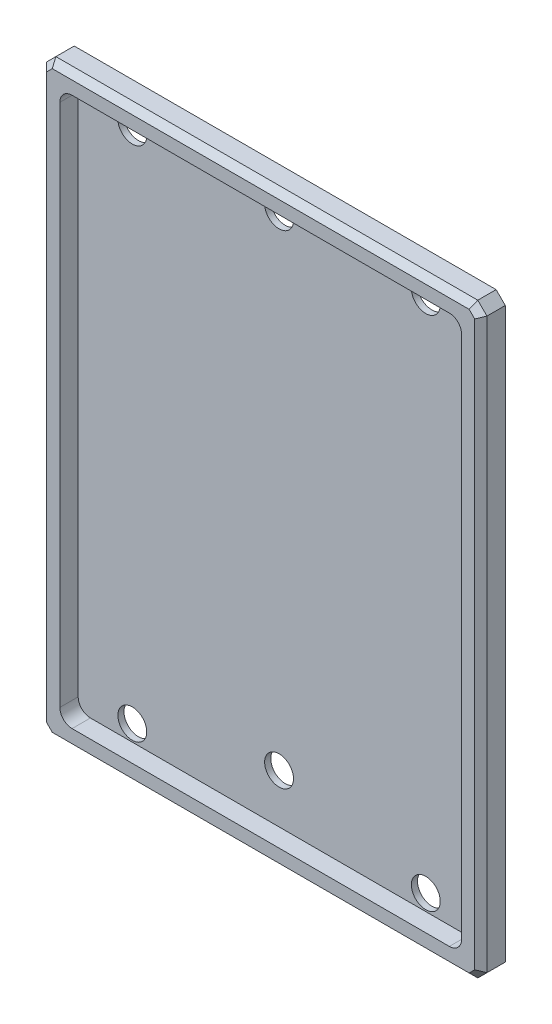
ISO-10303-21;
HEADER;
FILE_DESCRIPTION(('STEP AP214'),'2;1');
FILE_NAME('part.step','',(''),(''),'','','');
FILE_SCHEMA(('AUTOMOTIVE_DESIGN { 1 0 10303 214 1 1 1 1 }'));
ENDSEC;
DATA;
#1=APPLICATION_CONTEXT('core data for automotive mechanical design processes');
#2=APPLICATION_PROTOCOL_DEFINITION('international standard','automotive_design',2000,#1);
#3=PRODUCT_CONTEXT('',#1,'mechanical');
#4=PRODUCT('Part','Part','',(#3));
#5=PRODUCT_RELATED_PRODUCT_CATEGORY('part','',(#4));
#6=PRODUCT_DEFINITION_FORMATION('','',#4);
#7=PRODUCT_DEFINITION_CONTEXT('part definition',#1,'design');
#8=PRODUCT_DEFINITION('design','',#6,#7);
#9=PRODUCT_DEFINITION_SHAPE('','',#8);
#10=(LENGTH_UNIT() NAMED_UNIT(*) SI_UNIT(.MILLI.,.METRE.));
#11=(NAMED_UNIT(*) PLANE_ANGLE_UNIT() SI_UNIT($,.RADIAN.));
#12=(NAMED_UNIT(*) SI_UNIT($,.STERADIAN.) SOLID_ANGLE_UNIT());
#13=UNCERTAINTY_MEASURE_WITH_UNIT(LENGTH_MEASURE(1.E-05),#10,'distance_accuracy_value','');
#14=(GEOMETRIC_REPRESENTATION_CONTEXT(3) GLOBAL_UNCERTAINTY_ASSIGNED_CONTEXT((#13)) GLOBAL_UNIT_ASSIGNED_CONTEXT((#10,
#11,#12)) REPRESENTATION_CONTEXT('',''));
#15=CARTESIAN_POINT('',(0.,0.,0.));
#16=DIRECTION('',(0.,0.,1.));
#17=DIRECTION('',(1.,0.,0.));
#18=AXIS2_PLACEMENT_3D('',#15,#16,#17);
#19=CARTESIAN_POINT('',(-114.3,-152.4,12.7));
#20=DIRECTION('',(1.,0.,0.));
#21=DIRECTION('',(0.,0.,-1.));
#22=AXIS2_PLACEMENT_3D('',#19,#20,#21);
#23=PLANE('',#22);
#24=DIRECTION('',(0.,0.,1.));
#25=VECTOR('',#24,1.);
#26=CARTESIAN_POINT('',(-114.3,-147.6375,12.7));
#27=LINE('',#26,#25);
#28=CARTESIAN_POINT('',(-114.3,-147.6375,0.));
#29=VERTEX_POINT('',#28);
#30=CARTESIAN_POINT('',(-114.3,-147.6375,9.52499999999996));
#31=VERTEX_POINT('',#30);
#32=EDGE_CURVE('E341',#29,#31,#27,.T.);
#33=ORIENTED_EDGE('',*,*,#32,.T.);
#34=DIRECTION('',(0.,1.,0.));
#35=VECTOR('',#34,1.);
#36=CARTESIAN_POINT('',(-114.3,147.6375,9.52499999999996));
#37=LINE('',#36,#35);
#38=CARTESIAN_POINT('',(-114.3,147.6375,9.52499999999996));
#39=VERTEX_POINT('',#38);
#40=EDGE_CURVE('E11',#31,#39,#37,.T.);
#41=ORIENTED_EDGE('',*,*,#40,.T.);
#42=DIRECTION('',(0.,0.,-1.));
#43=VECTOR('',#42,1.);
#44=CARTESIAN_POINT('',(-114.3,147.6375,12.7));
#45=LINE('',#44,#43);
#46=CARTESIAN_POINT('',(-114.3,147.6375,0.));
#47=VERTEX_POINT('',#46);
#48=EDGE_CURVE('E339',#39,#47,#45,.T.);
#49=ORIENTED_EDGE('',*,*,#48,.T.);
#50=DIRECTION('',(0.,-1.,0.));
#51=VECTOR('',#50,1.);
#52=CARTESIAN_POINT('',(-114.3,-152.4,0.));
#53=LINE('',#52,#51);
#54=EDGE_CURVE('E301',#47,#29,#53,.T.);
#55=ORIENTED_EDGE('',*,*,#54,.T.);
#56=EDGE_LOOP('',(#33,#41,#49,#55));
#57=FACE_BOUND('',#56,.T.);
#58=ADVANCED_FACE('F41',(#57),#23,.F.);
#59=CARTESIAN_POINT('',(114.3,-152.4,12.7));
#60=DIRECTION('',(0.,1.,0.));
#61=DIRECTION('',(0.,0.,1.));
#62=AXIS2_PLACEMENT_3D('',#59,#60,#61);
#63=PLANE('',#62);
#64=DIRECTION('',(0.,0.,1.));
#65=VECTOR('',#64,1.);
#66=CARTESIAN_POINT('',(109.5375,-152.4,12.7));
#67=LINE('',#66,#65);
#68=CARTESIAN_POINT('',(109.5375,-152.4,0.));
#69=VERTEX_POINT('',#68);
#70=CARTESIAN_POINT('',(109.5375,-152.4,9.52499999999996));
#71=VERTEX_POINT('',#70);
#72=EDGE_CURVE('E327',#69,#71,#67,.T.);
#73=ORIENTED_EDGE('',*,*,#72,.T.);
#74=DIRECTION('',(-1.,0.,0.));
#75=VECTOR('',#74,1.);
#76=CARTESIAN_POINT('',(-109.5375,-152.4,9.52499999999996));
#77=LINE('',#76,#75);
#78=CARTESIAN_POINT('',(-109.5375,-152.4,9.52499999999996));
#79=VERTEX_POINT('',#78);
#80=EDGE_CURVE('E66',#71,#79,#77,.T.);
#81=ORIENTED_EDGE('',*,*,#80,.T.);
#82=DIRECTION('',(0.,0.,-1.));
#83=VECTOR('',#82,1.);
#84=CARTESIAN_POINT('',(-109.5375,-152.4,12.7));
#85=LINE('',#84,#83);
#86=CARTESIAN_POINT('',(-109.5375,-152.4,0.));
#87=VERTEX_POINT('',#86);
#88=EDGE_CURVE('E329',#79,#87,#85,.T.);
#89=ORIENTED_EDGE('',*,*,#88,.T.);
#90=DIRECTION('',(1.,0.,0.));
#91=VECTOR('',#90,1.);
#92=CARTESIAN_POINT('',(114.3,-152.4,0.));
#93=LINE('',#92,#91);
#94=EDGE_CURVE('E318',#87,#69,#93,.T.);
#95=ORIENTED_EDGE('',*,*,#94,.T.);
#96=EDGE_LOOP('',(#73,#81,#89,#95));
#97=FACE_BOUND('',#96,.T.);
#98=ADVANCED_FACE('F418',(#97),#63,.F.);
#99=CARTESIAN_POINT('',(114.3,-152.4,12.7));
#100=DIRECTION('',(-1.,0.,0.));
#101=DIRECTION('',(0.,0.,1.));
#102=AXIS2_PLACEMENT_3D('',#99,#100,#101);
#103=PLANE('',#102);
#104=DIRECTION('',(0.,0.,1.));
#105=VECTOR('',#104,1.);
#106=CARTESIAN_POINT('',(114.3,147.6375,12.7));
#107=LINE('',#106,#105);
#108=CARTESIAN_POINT('',(114.3,147.6375,0.));
#109=VERTEX_POINT('',#108);
#110=CARTESIAN_POINT('',(114.3,147.6375,9.52499999999996));
#111=VERTEX_POINT('',#110);
#112=EDGE_CURVE('E343',#109,#111,#107,.T.);
#113=ORIENTED_EDGE('',*,*,#112,.T.);
#114=DIRECTION('',(0.,-1.,0.));
#115=VECTOR('',#114,1.);
#116=CARTESIAN_POINT('',(114.3,-147.6375,9.52499999999996));
#117=LINE('',#116,#115);
#118=CARTESIAN_POINT('',(114.3,-147.6375,9.52499999999996));
#119=VERTEX_POINT('',#118);
#120=EDGE_CURVE('E377',#111,#119,#117,.T.);
#121=ORIENTED_EDGE('',*,*,#120,.T.);
#122=DIRECTION('',(0.,0.,-1.));
#123=VECTOR('',#122,1.);
#124=CARTESIAN_POINT('',(114.3,-147.6375,12.7));
#125=LINE('',#124,#123);
#126=CARTESIAN_POINT('',(114.3,-147.6375,0.));
#127=VERTEX_POINT('',#126);
#128=EDGE_CURVE('E346',#119,#127,#125,.T.);
#129=ORIENTED_EDGE('',*,*,#128,.T.);
#130=DIRECTION('',(0.,1.,0.));
#131=VECTOR('',#130,1.);
#132=CARTESIAN_POINT('',(114.3,-152.4,0.));
#133=LINE('',#132,#131);
#134=EDGE_CURVE('E321',#127,#109,#133,.T.);
#135=ORIENTED_EDGE('',*,*,#134,.T.);
#136=EDGE_LOOP('',(#113,#121,#129,#135));
#137=FACE_BOUND('',#136,.T.);
#138=ADVANCED_FACE('F429',(#137),#103,.F.);
#139=CARTESIAN_POINT('',(114.3,152.4,12.7));
#140=DIRECTION('',(0.,-1.,0.));
#141=DIRECTION('',(0.,0.,-1.));
#142=AXIS2_PLACEMENT_3D('',#139,#140,#141);
#143=PLANE('',#142);
#144=DIRECTION('',(0.,0.,1.));
#145=VECTOR('',#144,1.);
#146=CARTESIAN_POINT('',(-109.5375,152.4,12.7));
#147=LINE('',#146,#145);
#148=CARTESIAN_POINT('',(-109.5375,152.4,0.));
#149=VERTEX_POINT('',#148);
#150=CARTESIAN_POINT('',(-109.5375,152.4,9.52499999999996));
#151=VERTEX_POINT('',#150);
#152=EDGE_CURVE('E350',#149,#151,#147,.T.);
#153=ORIENTED_EDGE('',*,*,#152,.T.);
#154=DIRECTION('',(1.,0.,0.));
#155=VECTOR('',#154,1.);
#156=CARTESIAN_POINT('',(109.5375,152.4,9.52499999999996));
#157=LINE('',#156,#155);
#158=CARTESIAN_POINT('',(109.5375,152.4,9.52499999999996));
#159=VERTEX_POINT('',#158);
#160=EDGE_CURVE('E373',#151,#159,#157,.T.);
#161=ORIENTED_EDGE('',*,*,#160,.T.);
#162=DIRECTION('',(0.,0.,-1.));
#163=VECTOR('',#162,1.);
#164=CARTESIAN_POINT('',(109.5375,152.4,12.7));
#165=LINE('',#164,#163);
#166=CARTESIAN_POINT('',(109.5375,152.4,0.));
#167=VERTEX_POINT('',#166);
#168=EDGE_CURVE('E348',#159,#167,#165,.T.);
#169=ORIENTED_EDGE('',*,*,#168,.T.);
#170=DIRECTION('',(-1.,0.,0.));
#171=VECTOR('',#170,1.);
#172=CARTESIAN_POINT('',(114.3,152.4,0.));
#173=LINE('',#172,#171);
#174=EDGE_CURVE('E324',#167,#149,#173,.T.);
#175=ORIENTED_EDGE('',*,*,#174,.T.);
#176=EDGE_LOOP('',(#153,#161,#169,#175));
#177=FACE_BOUND('',#176,.T.);
#178=ADVANCED_FACE('F798',(#177),#143,.F.);
#179=CARTESIAN_POINT('',(0.,0.,12.7));
#180=DIRECTION('',(0.,0.,1.));
#181=DIRECTION('',(1.,0.,0.));
#182=AXIS2_PLACEMENT_3D('',#179,#180,#181);
#183=PLANE('',#182);
#184=DIRECTION('',(-1.,0.,0.));
#185=VECTOR('',#184,1.);
#186=CARTESIAN_POINT('',(-109.5375,149.225,12.7));
#187=LINE('',#186,#185);
#188=CARTESIAN_POINT('',(108.222371939465,149.225,12.7));
#189=VERTEX_POINT('',#188);
#190=CARTESIAN_POINT('',(-108.222371939465,149.225,12.7));
#191=VERTEX_POINT('',#190);
#192=EDGE_CURVE('E365',#189,#191,#187,.T.);
#193=ORIENTED_EDGE('',*,*,#192,.T.);
#194=DIRECTION('',(-0.707106781186548,-0.707106781186548,0.));
#195=VECTOR('',#194,1.);
#196=CARTESIAN_POINT('',(-128.723685969733,128.723685969733,12.7));
#197=LINE('',#196,#195);
#198=CARTESIAN_POINT('',(-111.125,146.322371939465,12.7));
#199=VERTEX_POINT('',#198);
#200=EDGE_CURVE('E367',#191,#199,#197,.T.);
#201=ORIENTED_EDGE('',*,*,#200,.T.);
#202=DIRECTION('',(0.,-1.,0.));
#203=VECTOR('',#202,1.);
#204=CARTESIAN_POINT('',(-111.125,-147.6375,12.7));
#205=LINE('',#204,#203);
#206=CARTESIAN_POINT('',(-111.125,-146.322371939465,12.7));
#207=VERTEX_POINT('',#206);
#208=EDGE_CURVE('E353',#199,#207,#205,.T.);
#209=ORIENTED_EDGE('',*,*,#208,.T.);
#210=DIRECTION('',(0.707106781186548,-0.707106781186548,0.));
#211=VECTOR('',#210,1.);
#212=CARTESIAN_POINT('',(-128.723685969733,-128.723685969733,12.7));
#213=LINE('',#212,#211);
#214=CARTESIAN_POINT('',(-108.222371939465,-149.225,12.7));
#215=VERTEX_POINT('',#214);
#216=EDGE_CURVE('E355',#207,#215,#213,.T.);
#217=ORIENTED_EDGE('',*,*,#216,.T.);
#218=DIRECTION('',(1.,0.,0.));
#219=VECTOR('',#218,1.);
#220=CARTESIAN_POINT('',(109.5375,-149.225,12.7));
#221=LINE('',#220,#219);
#222=CARTESIAN_POINT('',(108.222371939465,-149.225,12.7));
#223=VERTEX_POINT('',#222);
#224=EDGE_CURVE('E357',#215,#223,#221,.T.);
#225=ORIENTED_EDGE('',*,*,#224,.T.);
#226=DIRECTION('',(0.707106781186548,0.707106781186548,0.));
#227=VECTOR('',#226,1.);
#228=CARTESIAN_POINT('',(128.723685969733,-128.723685969733,12.7));
#229=LINE('',#228,#227);
#230=CARTESIAN_POINT('',(111.125,-146.322371939465,12.7));
#231=VERTEX_POINT('',#230);
#232=EDGE_CURVE('E359',#223,#231,#229,.T.);
#233=ORIENTED_EDGE('',*,*,#232,.T.);
#234=DIRECTION('',(0.,1.,0.));
#235=VECTOR('',#234,1.);
#236=CARTESIAN_POINT('',(111.125,147.6375,12.7));
#237=LINE('',#236,#235);
#238=CARTESIAN_POINT('',(111.125,146.322371939465,12.7));
#239=VERTEX_POINT('',#238);
#240=EDGE_CURVE('E361',#231,#239,#237,.T.);
#241=ORIENTED_EDGE('',*,*,#240,.T.);
#242=DIRECTION('',(-0.707106781186548,0.707106781186548,0.));
#243=VECTOR('',#242,1.);
#244=CARTESIAN_POINT('',(128.723685969733,128.723685969733,12.7));
#245=LINE('',#244,#243);
#246=EDGE_CURVE('E363',#239,#189,#245,.T.);
#247=ORIENTED_EDGE('',*,*,#246,.T.);
#248=EDGE_LOOP('',(#193,#201,#209,#217,#225,#233,#241,#247));
#249=FACE_BOUND('',#248,.T.);
#250=CARTESIAN_POINT('',(-97.95,-136.05,12.7));
#251=DIRECTION('',(0.,0.,1.));
#252=DIRECTION('',(-1.,0.,0.));
#253=AXIS2_PLACEMENT_3D('',#250,#251,#252);
#254=CIRCLE('',#253,6.34999999999999);
#255=CARTESIAN_POINT('',(-104.3,-136.05,12.7));
#256=VERTEX_POINT('',#255);
#257=CARTESIAN_POINT('',(-97.95,-142.4,12.7));
#258=VERTEX_POINT('',#257);
#259=EDGE_CURVE('E249',#256,#258,#254,.T.);
#260=ORIENTED_EDGE('',*,*,#259,.F.);
#261=DIRECTION('',(0.,-1.,0.));
#262=VECTOR('',#261,1.);
#263=CARTESIAN_POINT('',(-104.3,-136.05,12.7));
#264=LINE('',#263,#262);
#265=CARTESIAN_POINT('',(-104.3,136.05,12.7));
#266=VERTEX_POINT('',#265);
#267=EDGE_CURVE('E256',#266,#256,#264,.T.);
#268=ORIENTED_EDGE('',*,*,#267,.F.);
#269=CARTESIAN_POINT('',(-97.95,136.05,12.7));
#270=DIRECTION('',(0.,0.,1.));
#271=DIRECTION('',(1.,0.,0.));
#272=AXIS2_PLACEMENT_3D('',#269,#270,#271);
#273=CIRCLE('',#272,6.34999999999999);
#274=CARTESIAN_POINT('',(-97.95,142.4,12.7));
#275=VERTEX_POINT('',#274);
#276=EDGE_CURVE('E294',#275,#266,#273,.T.);
#277=ORIENTED_EDGE('',*,*,#276,.F.);
#278=DIRECTION('',(-1.,0.,0.));
#279=VECTOR('',#278,1.);
#280=CARTESIAN_POINT('',(97.9500000000001,142.4,12.7));
#281=LINE('',#280,#279);
#282=CARTESIAN_POINT('',(97.9500000000001,142.4,12.7));
#283=VERTEX_POINT('',#282);
#284=EDGE_CURVE('E291',#283,#275,#281,.T.);
#285=ORIENTED_EDGE('',*,*,#284,.F.);
#286=CARTESIAN_POINT('',(97.9500000000001,136.05,12.7));
#287=DIRECTION('',(0.,0.,1.));
#288=DIRECTION('',(1.,0.,0.));
#289=AXIS2_PLACEMENT_3D('',#286,#287,#288);
#290=CIRCLE('',#289,6.34999999999999);
#291=CARTESIAN_POINT('',(104.3,136.05,12.7));
#292=VERTEX_POINT('',#291);
#293=EDGE_CURVE('E288',#292,#283,#290,.T.);
#294=ORIENTED_EDGE('',*,*,#293,.F.);
#295=DIRECTION('',(0.,1.,0.));
#296=VECTOR('',#295,1.);
#297=CARTESIAN_POINT('',(104.3,-136.05,12.7));
#298=LINE('',#297,#296);
#299=CARTESIAN_POINT('',(104.3,-136.05,12.7));
#300=VERTEX_POINT('',#299);
#301=EDGE_CURVE('E285',#300,#292,#298,.T.);
#302=ORIENTED_EDGE('',*,*,#301,.F.);
#303=CARTESIAN_POINT('',(97.9500000000001,-136.05,12.7));
#304=DIRECTION('',(0.,0.,1.));
#305=DIRECTION('',(1.,0.,0.));
#306=AXIS2_PLACEMENT_3D('',#303,#304,#305);
#307=CIRCLE('',#306,6.34999999999999);
#308=CARTESIAN_POINT('',(97.9500000000001,-142.4,12.7));
#309=VERTEX_POINT('',#308);
#310=EDGE_CURVE('E282',#309,#300,#307,.T.);
#311=ORIENTED_EDGE('',*,*,#310,.F.);
#312=DIRECTION('',(1.,0.,0.));
#313=VECTOR('',#312,1.);
#314=CARTESIAN_POINT('',(97.9500000000001,-142.4,12.7));
#315=LINE('',#314,#313);
#316=EDGE_CURVE('E279',#258,#309,#315,.T.);
#317=ORIENTED_EDGE('',*,*,#316,.F.);
#318=EDGE_LOOP('',(#260,#268,#277,#285,#294,#302,#311,#317));
#319=FACE_BOUND('',#318,.T.);
#320=ADVANCED_FACE('F445',(#249,#319),#183,.T.);
#321=CARTESIAN_POINT('',(0.,0.,0.));
#322=DIRECTION('',(0.,0.,1.));
#323=DIRECTION('',(1.,0.,0.));
#324=AXIS2_PLACEMENT_3D('',#321,#322,#323);
#325=PLANE('',#324);
#326=CARTESIAN_POINT('',(109.3,-102.4,0.));
#327=DIRECTION('',(0.,0.,-1.));
#328=DIRECTION('',(-1.,0.,0.));
#329=AXIS2_PLACEMENT_3D('',#326,#327,#328);
#330=CIRCLE('',#329,1.64999999999998);
#331=CARTESIAN_POINT('',(107.65,-102.4,0.));
#332=VERTEX_POINT('',#331);
#333=EDGE_CURVE('E199',#332,#332,#330,.T.);
#334=ORIENTED_EDGE('',*,*,#333,.F.);
#335=EDGE_LOOP('',(#334));
#336=FACE_BOUND('',#335,.T.);
#337=CARTESIAN_POINT('',(109.3,0.,0.));
#338=DIRECTION('',(0.,0.,-1.));
#339=DIRECTION('',(-1.,0.,0.));
#340=AXIS2_PLACEMENT_3D('',#337,#338,#339);
#341=CIRCLE('',#340,1.64999999999998);
#342=CARTESIAN_POINT('',(107.65,0.,0.));
#343=VERTEX_POINT('',#342);
#344=EDGE_CURVE('E198',#343,#343,#341,.T.);
#345=ORIENTED_EDGE('',*,*,#344,.F.);
#346=EDGE_LOOP('',(#345));
#347=FACE_BOUND('',#346,.T.);
#348=CARTESIAN_POINT('',(109.3,113.6,0.));
#349=DIRECTION('',(0.,0.,-1.));
#350=DIRECTION('',(-1.,0.,0.));
#351=AXIS2_PLACEMENT_3D('',#348,#349,#350);
#352=CIRCLE('',#351,1.64999999999998);
#353=CARTESIAN_POINT('',(107.65,113.6,0.));
#354=VERTEX_POINT('',#353);
#355=EDGE_CURVE('E209',#354,#354,#352,.T.);
#356=ORIENTED_EDGE('',*,*,#355,.F.);
#357=EDGE_LOOP('',(#356));
#358=FACE_BOUND('',#357,.T.);
#359=CARTESIAN_POINT('',(0.,134.05,0.));
#360=DIRECTION('',(0.,0.,1.));
#361=DIRECTION('',(1.,0.,0.));
#362=AXIS2_PLACEMENT_3D('',#359,#360,#361);
#363=CIRCLE('',#362,7.5);
#364=CARTESIAN_POINT('',(7.5,134.05,0.));
#365=VERTEX_POINT('',#364);
#366=EDGE_CURVE('E229',#365,#365,#363,.T.);
#367=ORIENTED_EDGE('',*,*,#366,.T.);
#368=EDGE_LOOP('',(#367));
#369=FACE_BOUND('',#368,.T.);
#370=CARTESIAN_POINT('',(76.2,-134.05,0.));
#371=DIRECTION('',(0.,0.,1.));
#372=DIRECTION('',(1.,0.,0.));
#373=AXIS2_PLACEMENT_3D('',#370,#371,#372);
#374=CIRCLE('',#373,7.50000000000001);
#375=CARTESIAN_POINT('',(83.7,-134.05,0.));
#376=VERTEX_POINT('',#375);
#377=EDGE_CURVE('E222',#376,#376,#374,.T.);
#378=ORIENTED_EDGE('',*,*,#377,.T.);
#379=EDGE_LOOP('',(#378));
#380=FACE_BOUND('',#379,.T.);
#381=CARTESIAN_POINT('',(-76.2,-134.05,0.));
#382=DIRECTION('',(0.,0.,1.));
#383=DIRECTION('',(1.,0.,0.));
#384=AXIS2_PLACEMENT_3D('',#381,#382,#383);
#385=CIRCLE('',#384,7.50000000000001);
#386=CARTESIAN_POINT('',(-68.7,-134.05,0.));
#387=VERTEX_POINT('',#386);
#388=EDGE_CURVE('E241',#387,#387,#385,.T.);
#389=ORIENTED_EDGE('',*,*,#388,.T.);
#390=EDGE_LOOP('',(#389));
#391=FACE_BOUND('',#390,.T.);
#392=CARTESIAN_POINT('',(76.2,134.05,0.));
#393=DIRECTION('',(0.,0.,1.));
#394=DIRECTION('',(1.,0.,0.));
#395=AXIS2_PLACEMENT_3D('',#392,#393,#394);
#396=CIRCLE('',#395,7.50000000000001);
#397=CARTESIAN_POINT('',(83.7,134.05,0.));
#398=VERTEX_POINT('',#397);
#399=EDGE_CURVE('E234',#398,#398,#396,.T.);
#400=ORIENTED_EDGE('',*,*,#399,.T.);
#401=EDGE_LOOP('',(#400));
#402=FACE_BOUND('',#401,.T.);
#403=CARTESIAN_POINT('',(0.,-117.,0.));
#404=DIRECTION('',(0.,0.,1.));
#405=DIRECTION('',(1.,0.,0.));
#406=AXIS2_PLACEMENT_3D('',#403,#404,#405);
#407=CIRCLE('',#406,7.5);
#408=CARTESIAN_POINT('',(7.5,-117.,0.));
#409=VERTEX_POINT('',#408);
#410=EDGE_CURVE('E216',#409,#409,#407,.T.);
#411=ORIENTED_EDGE('',*,*,#410,.T.);
#412=EDGE_LOOP('',(#411));
#413=FACE_BOUND('',#412,.T.);
#414=CARTESIAN_POINT('',(-76.2,134.05,0.));
#415=DIRECTION('',(0.,0.,1.));
#416=DIRECTION('',(1.,0.,0.));
#417=AXIS2_PLACEMENT_3D('',#414,#415,#416);
#418=CIRCLE('',#417,7.50000000000001);
#419=CARTESIAN_POINT('',(-68.7,134.05,0.));
#420=VERTEX_POINT('',#419);
#421=EDGE_CURVE('E246',#420,#420,#418,.T.);
#422=ORIENTED_EDGE('',*,*,#421,.T.);
#423=EDGE_LOOP('',(#422));
#424=FACE_BOUND('',#423,.T.);
#425=ORIENTED_EDGE('',*,*,#94,.F.);
#426=DIRECTION('',(0.707106781186548,-0.707106781186548,0.));
#427=VECTOR('',#426,1.);
#428=CARTESIAN_POINT('',(-109.5375,-152.4,0.));
#429=LINE('',#428,#427);
#430=EDGE_CURVE('E337',#87,#29,#429,.F.);
#431=ORIENTED_EDGE('',*,*,#430,.T.);
#432=ORIENTED_EDGE('',*,*,#54,.F.);
#433=DIRECTION('',(-0.707106781186548,-0.707106781186548,0.));
#434=VECTOR('',#433,1.);
#435=CARTESIAN_POINT('',(-114.3,147.6375,0.));
#436=LINE('',#435,#434);
#437=EDGE_CURVE('E333',#47,#149,#436,.F.);
#438=ORIENTED_EDGE('',*,*,#437,.T.);
#439=ORIENTED_EDGE('',*,*,#174,.F.);
#440=DIRECTION('',(-0.707106781186548,0.707106781186548,0.));
#441=VECTOR('',#440,1.);
#442=CARTESIAN_POINT('',(109.5375,152.4,0.));
#443=LINE('',#442,#441);
#444=EDGE_CURVE('E331',#167,#109,#443,.F.);
#445=ORIENTED_EDGE('',*,*,#444,.T.);
#446=ORIENTED_EDGE('',*,*,#134,.F.);
#447=DIRECTION('',(0.707106781186548,0.707106781186548,0.));
#448=VECTOR('',#447,1.);
#449=CARTESIAN_POINT('',(114.3,-147.6375,0.));
#450=LINE('',#449,#448);
#451=EDGE_CURVE('E335',#127,#69,#450,.F.);
#452=ORIENTED_EDGE('',*,*,#451,.T.);
#453=EDGE_LOOP('',(#425,#431,#432,#438,#439,#445,#446,#452));
#454=FACE_BOUND('',#453,.T.);
#455=ADVANCED_FACE('F422',(#336,#347,#358,#369,#380,#391,#402,#413,#424,#454),#325,.F.);
#456=CARTESIAN_POINT('',(-97.95,-136.05,3.175));
#457=DIRECTION('',(0.,0.,1.));
#458=DIRECTION('',(1.,0.,0.));
#459=AXIS2_PLACEMENT_3D('',#456,#457,#458);
#460=CYLINDRICAL_SURFACE('',#459,6.34999999999999);
#461=ORIENTED_EDGE('',*,*,#259,.T.);
#462=DIRECTION('',(0.,0.,1.));
#463=VECTOR('',#462,1.);
#464=CARTESIAN_POINT('',(-97.95,-142.4,3.175));
#465=LINE('',#464,#463);
#466=CARTESIAN_POINT('',(-97.95,-142.4,3.175));
#467=VERTEX_POINT('',#466);
#468=EDGE_CURVE('E277',#467,#258,#465,.T.);
#469=ORIENTED_EDGE('',*,*,#468,.F.);
#470=CARTESIAN_POINT('',(-97.95,-136.05,3.175));
#471=DIRECTION('',(0.,0.,1.));
#472=DIRECTION('',(-1.,0.,0.));
#473=AXIS2_PLACEMENT_3D('',#470,#471,#472);
#474=CIRCLE('',#473,6.34999999999999);
#475=CARTESIAN_POINT('',(-104.3,-136.05,3.175));
#476=VERTEX_POINT('',#475);
#477=EDGE_CURVE('E252',#476,#467,#474,.T.);
#478=ORIENTED_EDGE('',*,*,#477,.F.);
#479=DIRECTION('',(0.,0.,1.));
#480=VECTOR('',#479,1.);
#481=CARTESIAN_POINT('',(-104.3,-136.05,3.175));
#482=LINE('',#481,#480);
#483=EDGE_CURVE('E299',#476,#256,#482,.T.);
#484=ORIENTED_EDGE('',*,*,#483,.T.);
#485=EDGE_LOOP('',(#461,#469,#478,#484));
#486=FACE_BOUND('',#485,.T.);
#487=ADVANCED_FACE('F773',(#486),#460,.F.);
#488=CARTESIAN_POINT('',(-104.3,-136.05,3.175));
#489=DIRECTION('',(-1.,0.,0.));
#490=DIRECTION('',(0.,0.,1.));
#491=AXIS2_PLACEMENT_3D('',#488,#489,#490);
#492=PLANE('',#491);
#493=ORIENTED_EDGE('',*,*,#267,.T.);
#494=ORIENTED_EDGE('',*,*,#483,.F.);
#495=DIRECTION('',(0.,-1.,0.));
#496=VECTOR('',#495,1.);
#497=CARTESIAN_POINT('',(-104.3,-136.05,3.175));
#498=LINE('',#497,#496);
#499=CARTESIAN_POINT('',(-104.3,136.05,3.175));
#500=VERTEX_POINT('',#499);
#501=EDGE_CURVE('E274',#500,#476,#498,.T.);
#502=ORIENTED_EDGE('',*,*,#501,.F.);
#503=DIRECTION('',(0.,0.,1.));
#504=VECTOR('',#503,1.);
#505=CARTESIAN_POINT('',(-104.3,136.05,3.175));
#506=LINE('',#505,#504);
#507=EDGE_CURVE('E302',#500,#266,#506,.T.);
#508=ORIENTED_EDGE('',*,*,#507,.T.);
#509=EDGE_LOOP('',(#493,#494,#502,#508));
#510=FACE_BOUND('',#509,.T.);
#511=ADVANCED_FACE('F764',(#510),#492,.F.);
#512=CARTESIAN_POINT('',(-97.95,136.05,3.175));
#513=DIRECTION('',(0.,0.,1.));
#514=DIRECTION('',(1.,0.,0.));
#515=AXIS2_PLACEMENT_3D('',#512,#513,#514);
#516=CYLINDRICAL_SURFACE('',#515,6.34999999999999);
#517=ORIENTED_EDGE('',*,*,#276,.T.);
#518=ORIENTED_EDGE('',*,*,#507,.F.);
#519=CARTESIAN_POINT('',(-97.95,136.05,3.175));
#520=DIRECTION('',(0.,0.,1.));
#521=DIRECTION('',(1.,0.,0.));
#522=AXIS2_PLACEMENT_3D('',#519,#520,#521);
#523=CIRCLE('',#522,6.34999999999999);
#524=CARTESIAN_POINT('',(-97.95,142.4,3.175));
#525=VERTEX_POINT('',#524);
#526=EDGE_CURVE('E271',#525,#500,#523,.T.);
#527=ORIENTED_EDGE('',*,*,#526,.F.);
#528=DIRECTION('',(0.,0.,1.));
#529=VECTOR('',#528,1.);
#530=CARTESIAN_POINT('',(-97.95,142.4,3.175));
#531=LINE('',#530,#529);
#532=EDGE_CURVE('E304',#525,#275,#531,.T.);
#533=ORIENTED_EDGE('',*,*,#532,.T.);
#534=EDGE_LOOP('',(#517,#518,#527,#533));
#535=FACE_BOUND('',#534,.T.);
#536=ADVANCED_FACE('F755',(#535),#516,.F.);
#537=CARTESIAN_POINT('',(97.9500000000001,142.4,3.175));
#538=DIRECTION('',(0.,1.,0.));
#539=DIRECTION('',(0.,0.,1.));
#540=AXIS2_PLACEMENT_3D('',#537,#538,#539);
#541=PLANE('',#540);
#542=ORIENTED_EDGE('',*,*,#284,.T.);
#543=ORIENTED_EDGE('',*,*,#532,.F.);
#544=DIRECTION('',(-1.,0.,0.));
#545=VECTOR('',#544,1.);
#546=CARTESIAN_POINT('',(97.9500000000001,142.4,3.175));
#547=LINE('',#546,#545);
#548=CARTESIAN_POINT('',(97.9500000000001,142.4,3.175));
#549=VERTEX_POINT('',#548);
#550=EDGE_CURVE('E268',#549,#525,#547,.T.);
#551=ORIENTED_EDGE('',*,*,#550,.F.);
#552=DIRECTION('',(0.,0.,1.));
#553=VECTOR('',#552,1.);
#554=CARTESIAN_POINT('',(97.9500000000001,142.4,3.175));
#555=LINE('',#554,#553);
#556=EDGE_CURVE('E306',#549,#283,#555,.T.);
#557=ORIENTED_EDGE('',*,*,#556,.T.);
#558=EDGE_LOOP('',(#542,#543,#551,#557));
#559=FACE_BOUND('',#558,.T.);
#560=ADVANCED_FACE('F746',(#559),#541,.F.);
#561=CARTESIAN_POINT('',(97.9500000000001,136.05,3.175));
#562=DIRECTION('',(0.,0.,1.));
#563=DIRECTION('',(1.,0.,0.));
#564=AXIS2_PLACEMENT_3D('',#561,#562,#563);
#565=CYLINDRICAL_SURFACE('',#564,6.34999999999999);
#566=ORIENTED_EDGE('',*,*,#293,.T.);
#567=ORIENTED_EDGE('',*,*,#556,.F.);
#568=CARTESIAN_POINT('',(97.9500000000001,136.05,3.175));
#569=DIRECTION('',(0.,0.,1.));
#570=DIRECTION('',(1.,0.,0.));
#571=AXIS2_PLACEMENT_3D('',#568,#569,#570);
#572=CIRCLE('',#571,6.34999999999999);
#573=CARTESIAN_POINT('',(104.3,136.05,3.175));
#574=VERTEX_POINT('',#573);
#575=EDGE_CURVE('E265',#574,#549,#572,.T.);
#576=ORIENTED_EDGE('',*,*,#575,.F.);
#577=DIRECTION('',(0.,0.,1.));
#578=VECTOR('',#577,1.);
#579=CARTESIAN_POINT('',(104.3,136.05,3.175));
#580=LINE('',#579,#578);
#581=EDGE_CURVE('E308',#574,#292,#580,.T.);
#582=ORIENTED_EDGE('',*,*,#581,.T.);
#583=EDGE_LOOP('',(#566,#567,#576,#582));
#584=FACE_BOUND('',#583,.T.);
#585=ADVANCED_FACE('F737',(#584),#565,.F.);
#586=CARTESIAN_POINT('',(104.3,-136.05,3.175));
#587=DIRECTION('',(1.,0.,0.));
#588=DIRECTION('',(0.,0.,-1.));
#589=AXIS2_PLACEMENT_3D('',#586,#587,#588);
#590=PLANE('',#589);
#591=ORIENTED_EDGE('',*,*,#301,.T.);
#592=ORIENTED_EDGE('',*,*,#581,.F.);
#593=DIRECTION('',(0.,1.,0.));
#594=VECTOR('',#593,1.);
#595=CARTESIAN_POINT('',(104.3,-136.05,3.175));
#596=LINE('',#595,#594);
#597=CARTESIAN_POINT('',(104.3,-136.05,3.175));
#598=VERTEX_POINT('',#597);
#599=EDGE_CURVE('E262',#598,#574,#596,.T.);
#600=ORIENTED_EDGE('',*,*,#599,.F.);
#601=DIRECTION('',(0.,0.,1.));
#602=VECTOR('',#601,1.);
#603=CARTESIAN_POINT('',(104.3,-136.05,3.175));
#604=LINE('',#603,#602);
#605=EDGE_CURVE('E310',#598,#300,#604,.T.);
#606=ORIENTED_EDGE('',*,*,#605,.T.);
#607=EDGE_LOOP('',(#591,#592,#600,#606));
#608=FACE_BOUND('',#607,.T.);
#609=ADVANCED_FACE('F728',(#608),#590,.F.);
#610=CARTESIAN_POINT('',(97.9500000000001,-136.05,3.175));
#611=DIRECTION('',(0.,0.,1.));
#612=DIRECTION('',(1.,0.,0.));
#613=AXIS2_PLACEMENT_3D('',#610,#611,#612);
#614=CYLINDRICAL_SURFACE('',#613,6.34999999999999);
#615=ORIENTED_EDGE('',*,*,#310,.T.);
#616=ORIENTED_EDGE('',*,*,#605,.F.);
#617=CARTESIAN_POINT('',(97.9500000000001,-136.05,3.175));
#618=DIRECTION('',(0.,0.,1.));
#619=DIRECTION('',(1.,0.,0.));
#620=AXIS2_PLACEMENT_3D('',#617,#618,#619);
#621=CIRCLE('',#620,6.34999999999999);
#622=CARTESIAN_POINT('',(97.9500000000001,-142.4,3.175));
#623=VERTEX_POINT('',#622);
#624=EDGE_CURVE('E259',#623,#598,#621,.T.);
#625=ORIENTED_EDGE('',*,*,#624,.F.);
#626=DIRECTION('',(0.,0.,1.));
#627=VECTOR('',#626,1.);
#628=CARTESIAN_POINT('',(97.9500000000001,-142.4,3.175));
#629=LINE('',#628,#627);
#630=EDGE_CURVE('E312',#623,#309,#629,.T.);
#631=ORIENTED_EDGE('',*,*,#630,.T.);
#632=EDGE_LOOP('',(#615,#616,#625,#631));
#633=FACE_BOUND('',#632,.T.);
#634=ADVANCED_FACE('F719',(#633),#614,.F.);
#635=CARTESIAN_POINT('',(97.9500000000001,-142.4,3.175));
#636=DIRECTION('',(0.,-1.,0.));
#637=DIRECTION('',(0.,0.,-1.));
#638=AXIS2_PLACEMENT_3D('',#635,#636,#637);
#639=PLANE('',#638);
#640=ORIENTED_EDGE('',*,*,#316,.T.);
#641=ORIENTED_EDGE('',*,*,#630,.F.);
#642=DIRECTION('',(1.,0.,0.));
#643=VECTOR('',#642,1.);
#644=CARTESIAN_POINT('',(97.9500000000001,-142.4,3.175));
#645=LINE('',#644,#643);
#646=EDGE_CURVE('E255',#467,#623,#645,.T.);
#647=ORIENTED_EDGE('',*,*,#646,.F.);
#648=ORIENTED_EDGE('',*,*,#468,.T.);
#649=EDGE_LOOP('',(#640,#641,#647,#648));
#650=FACE_BOUND('',#649,.T.);
#651=ADVANCED_FACE('F710',(#650),#639,.F.);
#652=CARTESIAN_POINT('',(-97.95,-136.05,3.175));
#653=DIRECTION('',(0.,0.,-1.));
#654=DIRECTION('',(-1.,0.,0.));
#655=AXIS2_PLACEMENT_3D('',#652,#653,#654);
#656=PLANE('',#655);
#657=CARTESIAN_POINT('',(0.,134.05,3.175));
#658=DIRECTION('',(0.,0.,1.));
#659=DIRECTION('',(1.,0.,0.));
#660=AXIS2_PLACEMENT_3D('',#657,#658,#659);
#661=CIRCLE('',#660,7.5);
#662=CARTESIAN_POINT('',(7.5,134.05,3.175));
#663=VERTEX_POINT('',#662);
#664=EDGE_CURVE('E219',#663,#663,#661,.T.);
#665=ORIENTED_EDGE('',*,*,#664,.F.);
#666=EDGE_LOOP('',(#665));
#667=FACE_BOUND('',#666,.T.);
#668=CARTESIAN_POINT('',(76.2,-134.05,3.175));
#669=DIRECTION('',(0.,0.,1.));
#670=DIRECTION('',(1.,0.,0.));
#671=AXIS2_PLACEMENT_3D('',#668,#669,#670);
#672=CIRCLE('',#671,7.50000000000001);
#673=CARTESIAN_POINT('',(83.7,-134.05,3.175));
#674=VERTEX_POINT('',#673);
#675=EDGE_CURVE('E226',#674,#674,#672,.T.);
#676=ORIENTED_EDGE('',*,*,#675,.F.);
#677=EDGE_LOOP('',(#676));
#678=FACE_BOUND('',#677,.T.);
#679=CARTESIAN_POINT('',(-76.2,-134.05,3.175));
#680=DIRECTION('',(0.,0.,1.));
#681=DIRECTION('',(1.,0.,0.));
#682=AXIS2_PLACEMENT_3D('',#679,#680,#681);
#683=CIRCLE('',#682,7.50000000000001);
#684=CARTESIAN_POINT('',(-68.7,-134.05,3.175));
#685=VERTEX_POINT('',#684);
#686=EDGE_CURVE('E225',#685,#685,#683,.T.);
#687=ORIENTED_EDGE('',*,*,#686,.F.);
#688=EDGE_LOOP('',(#687));
#689=FACE_BOUND('',#688,.T.);
#690=CARTESIAN_POINT('',(76.2,134.05,3.175));
#691=DIRECTION('',(0.,0.,1.));
#692=DIRECTION('',(1.,0.,0.));
#693=AXIS2_PLACEMENT_3D('',#690,#691,#692);
#694=CIRCLE('',#693,7.50000000000001);
#695=CARTESIAN_POINT('',(83.7,134.05,3.175));
#696=VERTEX_POINT('',#695);
#697=EDGE_CURVE('E238',#696,#696,#694,.T.);
#698=ORIENTED_EDGE('',*,*,#697,.F.);
#699=EDGE_LOOP('',(#698));
#700=FACE_BOUND('',#699,.T.);
#701=CARTESIAN_POINT('',(0.,-117.,3.175));
#702=DIRECTION('',(0.,0.,1.));
#703=DIRECTION('',(1.,0.,0.));
#704=AXIS2_PLACEMENT_3D('',#701,#702,#703);
#705=CIRCLE('',#704,7.5);
#706=CARTESIAN_POINT('',(7.5,-117.,3.175));
#707=VERTEX_POINT('',#706);
#708=EDGE_CURVE('E215',#707,#707,#705,.T.);
#709=ORIENTED_EDGE('',*,*,#708,.F.);
#710=EDGE_LOOP('',(#709));
#711=FACE_BOUND('',#710,.T.);
#712=CARTESIAN_POINT('',(-76.2,134.05,3.175));
#713=DIRECTION('',(0.,0.,1.));
#714=DIRECTION('',(1.,0.,0.));
#715=AXIS2_PLACEMENT_3D('',#712,#713,#714);
#716=CIRCLE('',#715,7.50000000000001);
#717=CARTESIAN_POINT('',(-68.7,134.05,3.175));
#718=VERTEX_POINT('',#717);
#719=EDGE_CURVE('E237',#718,#718,#716,.T.);
#720=ORIENTED_EDGE('',*,*,#719,.F.);
#721=EDGE_LOOP('',(#720));
#722=FACE_BOUND('',#721,.T.);
#723=ORIENTED_EDGE('',*,*,#477,.T.);
#724=ORIENTED_EDGE('',*,*,#646,.T.);
#725=ORIENTED_EDGE('',*,*,#624,.T.);
#726=ORIENTED_EDGE('',*,*,#599,.T.);
#727=ORIENTED_EDGE('',*,*,#575,.T.);
#728=ORIENTED_EDGE('',*,*,#550,.T.);
#729=ORIENTED_EDGE('',*,*,#526,.T.);
#730=ORIENTED_EDGE('',*,*,#501,.T.);
#731=EDGE_LOOP('',(#723,#724,#725,#726,#727,#728,#729,#730));
#732=FACE_BOUND('',#731,.T.);
#733=ADVANCED_FACE('F701',(#667,#678,#689,#700,#711,#722,#732),#656,.F.);
#734=CARTESIAN_POINT('',(-76.2,134.05,0.));
#735=DIRECTION('',(0.,0.,1.));
#736=DIRECTION('',(1.,0.,0.));
#737=AXIS2_PLACEMENT_3D('',#734,#735,#736);
#738=CYLINDRICAL_SURFACE('',#737,7.50000000000001);
#739=ORIENTED_EDGE('',*,*,#421,.F.);
#740=EDGE_LOOP('',(#739));
#741=FACE_BOUND('',#740,.T.);
#742=ORIENTED_EDGE('',*,*,#719,.T.);
#743=EDGE_LOOP('',(#742));
#744=FACE_BOUND('',#743,.T.);
#745=ADVANCED_FACE('F692',(#741,#744),#738,.F.);
#746=CARTESIAN_POINT('',(0.,-117.,0.));
#747=DIRECTION('',(0.,0.,1.));
#748=DIRECTION('',(1.,0.,0.));
#749=AXIS2_PLACEMENT_3D('',#746,#747,#748);
#750=CYLINDRICAL_SURFACE('',#749,7.5);
#751=ORIENTED_EDGE('',*,*,#410,.F.);
#752=EDGE_LOOP('',(#751));
#753=FACE_BOUND('',#752,.T.);
#754=ORIENTED_EDGE('',*,*,#708,.T.);
#755=EDGE_LOOP('',(#754));
#756=FACE_BOUND('',#755,.T.);
#757=ADVANCED_FACE('F683',(#753,#756),#750,.F.);
#758=CARTESIAN_POINT('',(76.2,134.05,0.));
#759=DIRECTION('',(0.,0.,1.));
#760=DIRECTION('',(1.,0.,0.));
#761=AXIS2_PLACEMENT_3D('',#758,#759,#760);
#762=CYLINDRICAL_SURFACE('',#761,7.50000000000001);
#763=ORIENTED_EDGE('',*,*,#399,.F.);
#764=EDGE_LOOP('',(#763));
#765=FACE_BOUND('',#764,.T.);
#766=ORIENTED_EDGE('',*,*,#697,.T.);
#767=EDGE_LOOP('',(#766));
#768=FACE_BOUND('',#767,.T.);
#769=ADVANCED_FACE('F674',(#765,#768),#762,.F.);
#770=CARTESIAN_POINT('',(-76.2,-134.05,0.));
#771=DIRECTION('',(0.,0.,1.));
#772=DIRECTION('',(1.,0.,0.));
#773=AXIS2_PLACEMENT_3D('',#770,#771,#772);
#774=CYLINDRICAL_SURFACE('',#773,7.50000000000001);
#775=ORIENTED_EDGE('',*,*,#388,.F.);
#776=EDGE_LOOP('',(#775));
#777=FACE_BOUND('',#776,.T.);
#778=ORIENTED_EDGE('',*,*,#686,.T.);
#779=EDGE_LOOP('',(#778));
#780=FACE_BOUND('',#779,.T.);
#781=ADVANCED_FACE('F665',(#777,#780),#774,.F.);
#782=CARTESIAN_POINT('',(76.2,-134.05,0.));
#783=DIRECTION('',(0.,0.,1.));
#784=DIRECTION('',(1.,0.,0.));
#785=AXIS2_PLACEMENT_3D('',#782,#783,#784);
#786=CYLINDRICAL_SURFACE('',#785,7.50000000000001);
#787=ORIENTED_EDGE('',*,*,#377,.F.);
#788=EDGE_LOOP('',(#787));
#789=FACE_BOUND('',#788,.T.);
#790=ORIENTED_EDGE('',*,*,#675,.T.);
#791=EDGE_LOOP('',(#790));
#792=FACE_BOUND('',#791,.T.);
#793=ADVANCED_FACE('F656',(#789,#792),#786,.F.);
#794=CARTESIAN_POINT('',(0.,134.05,0.));
#795=DIRECTION('',(0.,0.,1.));
#796=DIRECTION('',(1.,0.,0.));
#797=AXIS2_PLACEMENT_3D('',#794,#795,#796);
#798=CYLINDRICAL_SURFACE('',#797,7.5);
#799=ORIENTED_EDGE('',*,*,#366,.F.);
#800=EDGE_LOOP('',(#799));
#801=FACE_BOUND('',#800,.T.);
#802=ORIENTED_EDGE('',*,*,#664,.T.);
#803=EDGE_LOOP('',(#802));
#804=FACE_BOUND('',#803,.T.);
#805=ADVANCED_FACE('F647',(#801,#804),#798,.F.);
#806=CARTESIAN_POINT('',(109.3,113.6,8.));
#807=DIRECTION('',(0.,0.,-1.));
#808=DIRECTION('',(-1.,0.,0.));
#809=AXIS2_PLACEMENT_3D('',#806,#807,#808);
#810=CONICAL_SURFACE('',#809,1.65,1.02974425867665);
#811=CARTESIAN_POINT('',(109.3,113.6,8.99142002139547));
#812=VERTEX_POINT('',#811);
#813=VERTEX_LOOP('',#812);
#814=FACE_BOUND('',#813,.T.);
#815=CARTESIAN_POINT('',(109.3,113.6,8.));
#816=DIRECTION('',(0.,0.,-1.));
#817=DIRECTION('',(-1.,0.,0.));
#818=AXIS2_PLACEMENT_3D('',#815,#816,#817);
#819=CIRCLE('',#818,1.65);
#820=CARTESIAN_POINT('',(107.65,113.6,8.));
#821=VERTEX_POINT('',#820);
#822=EDGE_CURVE('E212',#821,#821,#819,.T.);
#823=ORIENTED_EDGE('',*,*,#822,.T.);
#824=EDGE_LOOP('',(#823));
#825=FACE_BOUND('',#824,.T.);
#826=ADVANCED_FACE('F637',(#814,#825),#810,.F.);
#827=CARTESIAN_POINT('',(109.3,113.6,0.));
#828=DIRECTION('',(0.,0.,-1.));
#829=DIRECTION('',(-1.,0.,0.));
#830=AXIS2_PLACEMENT_3D('',#827,#828,#829);
#831=CYLINDRICAL_SURFACE('',#830,1.64999999999999);
#832=ORIENTED_EDGE('',*,*,#822,.F.);
#833=EDGE_LOOP('',(#832));
#834=FACE_BOUND('',#833,.T.);
#835=ORIENTED_EDGE('',*,*,#355,.T.);
#836=EDGE_LOOP('',(#835));
#837=FACE_BOUND('',#836,.T.);
#838=ADVANCED_FACE('F628',(#834,#837),#831,.F.);
#839=CARTESIAN_POINT('',(109.3,0.,8.));
#840=DIRECTION('',(0.,0.,-1.));
#841=DIRECTION('',(-1.,0.,0.));
#842=AXIS2_PLACEMENT_3D('',#839,#840,#841);
#843=CONICAL_SURFACE('',#842,1.65,1.02974425867665);
#844=CARTESIAN_POINT('',(109.3,0.,8.99142002139547));
#845=VERTEX_POINT('',#844);
#846=VERTEX_LOOP('',#845);
#847=FACE_BOUND('',#846,.T.);
#848=CARTESIAN_POINT('',(109.3,0.,8.));
#849=DIRECTION('',(0.,0.,-1.));
#850=DIRECTION('',(-1.,0.,0.));
#851=AXIS2_PLACEMENT_3D('',#848,#849,#850);
#852=CIRCLE('',#851,1.65);
#853=CARTESIAN_POINT('',(107.65,0.,8.));
#854=VERTEX_POINT('',#853);
#855=EDGE_CURVE('E202',#854,#854,#852,.T.);
#856=ORIENTED_EDGE('',*,*,#855,.T.);
#857=EDGE_LOOP('',(#856));
#858=FACE_BOUND('',#857,.T.);
#859=ADVANCED_FACE('F618',(#847,#858),#843,.F.);
#860=CARTESIAN_POINT('',(109.3,0.,0.));
#861=DIRECTION('',(0.,0.,-1.));
#862=DIRECTION('',(-1.,0.,0.));
#863=AXIS2_PLACEMENT_3D('',#860,#861,#862);
#864=CYLINDRICAL_SURFACE('',#863,1.64999999999999);
#865=ORIENTED_EDGE('',*,*,#855,.F.);
#866=EDGE_LOOP('',(#865));
#867=FACE_BOUND('',#866,.T.);
#868=ORIENTED_EDGE('',*,*,#344,.T.);
#869=EDGE_LOOP('',(#868));
#870=FACE_BOUND('',#869,.T.);
#871=ADVANCED_FACE('F192',(#867,#870),#864,.F.);
#872=CARTESIAN_POINT('',(109.3,-102.4,8.));
#873=DIRECTION('',(0.,0.,-1.));
#874=DIRECTION('',(-1.,0.,0.));
#875=AXIS2_PLACEMENT_3D('',#872,#873,#874);
#876=CONICAL_SURFACE('',#875,1.65,1.02974425867665);
#877=CARTESIAN_POINT('',(109.3,-102.4,8.99142002139547));
#878=VERTEX_POINT('',#877);
#879=VERTEX_LOOP('',#878);
#880=FACE_BOUND('',#879,.T.);
#881=CARTESIAN_POINT('',(109.3,-102.4,8.));
#882=DIRECTION('',(0.,0.,-1.));
#883=DIRECTION('',(-1.,0.,0.));
#884=AXIS2_PLACEMENT_3D('',#881,#882,#883);
#885=CIRCLE('',#884,1.65);
#886=CARTESIAN_POINT('',(107.65,-102.4,8.));
#887=VERTEX_POINT('',#886);
#888=EDGE_CURVE('E196',#887,#887,#885,.T.);
#889=ORIENTED_EDGE('',*,*,#888,.T.);
#890=EDGE_LOOP('',(#889));
#891=FACE_BOUND('',#890,.T.);
#892=ADVANCED_FACE('F188',(#880,#891),#876,.F.);
#893=CARTESIAN_POINT('',(109.3,-102.4,0.));
#894=DIRECTION('',(0.,0.,-1.));
#895=DIRECTION('',(-1.,0.,0.));
#896=AXIS2_PLACEMENT_3D('',#893,#894,#895);
#897=CYLINDRICAL_SURFACE('',#896,1.64999999999999);
#898=ORIENTED_EDGE('',*,*,#888,.F.);
#899=EDGE_LOOP('',(#898));
#900=FACE_BOUND('',#899,.T.);
#901=ORIENTED_EDGE('',*,*,#333,.T.);
#902=EDGE_LOOP('',(#901));
#903=FACE_BOUND('',#902,.T.);
#904=ADVANCED_FACE('F191',(#900,#903),#897,.F.);
#905=CARTESIAN_POINT('',(-109.5375,-152.4,12.7));
#906=DIRECTION('',(0.707106781186547,0.707106781186547,0.));
#907=DIRECTION('',(0.,0.,-1.));
#908=AXIS2_PLACEMENT_3D('',#905,#906,#907);
#909=PLANE('',#908);
#910=ORIENTED_EDGE('',*,*,#88,.F.);
#911=DIRECTION('',(0.707106781186548,-0.707106781186548,0.));
#912=VECTOR('',#911,1.);
#913=CARTESIAN_POINT('',(-109.5375,-152.4,9.52499999999996));
#914=LINE('',#913,#912);
#915=EDGE_CURVE('E51',#79,#31,#914,.F.);
#916=ORIENTED_EDGE('',*,*,#915,.T.);
#917=ORIENTED_EDGE('',*,*,#32,.F.);
#918=ORIENTED_EDGE('',*,*,#430,.F.);
#919=EDGE_LOOP('',(#910,#916,#917,#918));
#920=FACE_BOUND('',#919,.T.);
#921=ADVANCED_FACE('F484',(#920),#909,.F.);
#922=CARTESIAN_POINT('',(114.3,-147.6375,12.7));
#923=DIRECTION('',(-0.707106781186547,0.707106781186547,0.));
#924=DIRECTION('',(0.,0.,-1.));
#925=AXIS2_PLACEMENT_3D('',#922,#923,#924);
#926=PLANE('',#925);
#927=ORIENTED_EDGE('',*,*,#128,.F.);
#928=DIRECTION('',(0.707106781186548,0.707106781186548,0.));
#929=VECTOR('',#928,1.);
#930=CARTESIAN_POINT('',(114.3,-147.6375,9.52499999999996));
#931=LINE('',#930,#929);
#932=EDGE_CURVE('E379',#119,#71,#931,.F.);
#933=ORIENTED_EDGE('',*,*,#932,.T.);
#934=ORIENTED_EDGE('',*,*,#72,.F.);
#935=ORIENTED_EDGE('',*,*,#451,.F.);
#936=EDGE_LOOP('',(#927,#933,#934,#935));
#937=FACE_BOUND('',#936,.T.);
#938=ADVANCED_FACE('F416',(#937),#926,.F.);
#939=CARTESIAN_POINT('',(-114.3,147.6375,12.7));
#940=DIRECTION('',(0.707106781186547,-0.707106781186547,0.));
#941=DIRECTION('',(0.,0.,-1.));
#942=AXIS2_PLACEMENT_3D('',#939,#940,#941);
#943=PLANE('',#942);
#944=ORIENTED_EDGE('',*,*,#48,.F.);
#945=DIRECTION('',(-0.707106781186548,-0.707106781186548,0.));
#946=VECTOR('',#945,1.);
#947=CARTESIAN_POINT('',(-114.3,147.6375,9.52499999999996));
#948=LINE('',#947,#946);
#949=EDGE_CURVE('E370',#39,#151,#948,.F.);
#950=ORIENTED_EDGE('',*,*,#949,.T.);
#951=ORIENTED_EDGE('',*,*,#152,.F.);
#952=ORIENTED_EDGE('',*,*,#437,.F.);
#953=EDGE_LOOP('',(#944,#950,#951,#952));
#954=FACE_BOUND('',#953,.T.);
#955=ADVANCED_FACE('F463',(#954),#943,.F.);
#956=CARTESIAN_POINT('',(109.5375,152.4,12.7));
#957=DIRECTION('',(-0.707106781186547,-0.707106781186547,0.));
#958=DIRECTION('',(0.,0.,-1.));
#959=AXIS2_PLACEMENT_3D('',#956,#957,#958);
#960=PLANE('',#959);
#961=ORIENTED_EDGE('',*,*,#168,.F.);
#962=DIRECTION('',(-0.707106781186548,0.707106781186548,0.));
#963=VECTOR('',#962,1.);
#964=CARTESIAN_POINT('',(109.5375,152.4,9.52499999999996));
#965=LINE('',#964,#963);
#966=EDGE_CURVE('E375',#159,#111,#965,.F.);
#967=ORIENTED_EDGE('',*,*,#966,.T.);
#968=ORIENTED_EDGE('',*,*,#112,.F.);
#969=ORIENTED_EDGE('',*,*,#444,.F.);
#970=EDGE_LOOP('',(#961,#967,#968,#969));
#971=FACE_BOUND('',#970,.T.);
#972=ADVANCED_FACE('F432',(#971),#960,.F.);
#973=CARTESIAN_POINT('',(128.723685969733,-128.723685969733,12.7));
#974=DIRECTION('',(0.499999999999999,-0.499999999999999,0.707106781186548));
#975=DIRECTION('',(-0.707106781186548,-0.707106781186548,0.));
#976=AXIS2_PLACEMENT_3D('',#973,#974,#975);
#977=PLANE('',#976);
#978=DIRECTION('',(-0.281084637714823,0.678598344545847,0.678598344545847));
#979=VECTOR('',#978,1.);
#980=CARTESIAN_POINT('',(99.6718767053271,-128.582278440737,33.3427215592629));
#981=LINE('',#980,#979);
#982=EDGE_CURVE('E398',#71,#223,#981,.T.);
#983=ORIENTED_EDGE('',*,*,#982,.F.);
#984=ORIENTED_EDGE('',*,*,#932,.F.);
#985=DIRECTION('',(-0.678598344545847,0.281084637714823,0.678598344545847));
#986=VECTOR('',#985,1.);
#987=CARTESIAN_POINT('',(115.87228326118,-148.288761050673,7.95271673882031));
#988=LINE('',#987,#986);
#989=EDGE_CURVE('E46',#231,#119,#988,.F.);
#990=ORIENTED_EDGE('',*,*,#989,.F.);
#991=ORIENTED_EDGE('',*,*,#232,.F.);
#992=EDGE_LOOP('',(#983,#984,#990,#991));
#993=FACE_BOUND('',#992,.T.);
#994=ADVANCED_FACE('F44',(#993),#977,.T.);
#995=CARTESIAN_POINT('',(111.125,0.,12.7));
#996=DIRECTION('',(0.707106781186548,0.,0.707106781186548));
#997=DIRECTION('',(0.,-1.,0.));
#998=AXIS2_PLACEMENT_3D('',#995,#996,#997);
#999=PLANE('',#998);
#1000=ORIENTED_EDGE('',*,*,#989,.T.);
#1001=ORIENTED_EDGE('',*,*,#120,.F.);
#1002=DIRECTION('',(-0.678598344545847,-0.281084637714823,0.678598344545847));
#1003=VECTOR('',#1002,1.);
#1004=CARTESIAN_POINT('',(83.2149484301931,134.761650052719,40.6100515698068));
#1005=LINE('',#1004,#1003);
#1006=EDGE_CURVE('E396',#239,#111,#1005,.F.);
#1007=ORIENTED_EDGE('',*,*,#1006,.F.);
#1008=ORIENTED_EDGE('',*,*,#240,.F.);
#1009=EDGE_LOOP('',(#1000,#1001,#1007,#1008));
#1010=FACE_BOUND('',#1009,.T.);
#1011=ADVANCED_FACE('F408',(#1010),#999,.T.);
#1012=CARTESIAN_POINT('',(0.,-149.225,12.7));
#1013=DIRECTION('',(0.,-0.707106781186548,0.707106781186548));
#1014=DIRECTION('',(-1.,0.,0.));
#1015=AXIS2_PLACEMENT_3D('',#1012,#1013,#1014);
#1016=PLANE('',#1015);
#1017=ORIENTED_EDGE('',*,*,#982,.T.);
#1018=ORIENTED_EDGE('',*,*,#224,.F.);
#1019=DIRECTION('',(0.281084637714816,0.678598344545848,0.678598344545848));
#1020=VECTOR('',#1019,1.);
#1021=CARTESIAN_POINT('',(-105.931657692737,-143.694726598028,18.2302734019724));
#1022=LINE('',#1021,#1020);
#1023=EDGE_CURVE('E393',#79,#215,#1022,.T.);
#1024=ORIENTED_EDGE('',*,*,#1023,.F.);
#1025=ORIENTED_EDGE('',*,*,#80,.F.);
#1026=EDGE_LOOP('',(#1017,#1018,#1024,#1025));
#1027=FACE_BOUND('',#1026,.T.);
#1028=ADVANCED_FACE('F449',(#1027),#1016,.T.);
#1029=CARTESIAN_POINT('',(128.723685969733,128.723685969733,12.7));
#1030=DIRECTION('',(0.499999999999999,0.499999999999999,0.707106781186548));
#1031=DIRECTION('',(0.707106781186548,-0.707106781186548,0.));
#1032=AXIS2_PLACEMENT_3D('',#1029,#1030,#1031);
#1033=PLANE('',#1032);
#1034=ORIENTED_EDGE('',*,*,#1006,.T.);
#1035=ORIENTED_EDGE('',*,*,#966,.F.);
#1036=DIRECTION('',(-0.281084637714823,-0.678598344545847,0.678598344545847));
#1037=VECTOR('',#1036,1.);
#1038=CARTESIAN_POINT('',(105.931657692737,143.694726598028,18.2302734019723));
#1039=LINE('',#1038,#1037);
#1040=EDGE_CURVE('E390',#189,#159,#1039,.F.);
#1041=ORIENTED_EDGE('',*,*,#1040,.F.);
#1042=ORIENTED_EDGE('',*,*,#246,.F.);
#1043=EDGE_LOOP('',(#1034,#1035,#1041,#1042));
#1044=FACE_BOUND('',#1043,.T.);
#1045=ADVANCED_FACE('F436',(#1044),#1033,.T.);
#1046=CARTESIAN_POINT('',(-128.723685969733,-128.723685969733,12.7));
#1047=DIRECTION('',(-0.500000000000001,-0.500000000000001,0.707106781186546));
#1048=DIRECTION('',(-0.707106781186548,0.707106781186548,0.));
#1049=AXIS2_PLACEMENT_3D('',#1046,#1047,#1048);
#1050=PLANE('',#1049);
#1051=ORIENTED_EDGE('',*,*,#1023,.T.);
#1052=ORIENTED_EDGE('',*,*,#216,.F.);
#1053=DIRECTION('',(0.678598344545848,0.281084637714816,0.678598344545848));
#1054=VECTOR('',#1053,1.);
#1055=CARTESIAN_POINT('',(-83.2149484301938,-134.761650052719,40.6100515698062));
#1056=LINE('',#1055,#1054);
#1057=EDGE_CURVE('E387',#31,#207,#1056,.T.);
#1058=ORIENTED_EDGE('',*,*,#1057,.F.);
#1059=ORIENTED_EDGE('',*,*,#915,.F.);
#1060=EDGE_LOOP('',(#1051,#1052,#1058,#1059));
#1061=FACE_BOUND('',#1060,.T.);
#1062=ADVANCED_FACE('F451',(#1061),#1050,.T.);
#1063=CARTESIAN_POINT('',(0.,149.225,12.7));
#1064=DIRECTION('',(0.,0.707106781186548,0.707106781186548));
#1065=DIRECTION('',(1.,0.,0.));
#1066=AXIS2_PLACEMENT_3D('',#1063,#1064,#1065);
#1067=PLANE('',#1066);
#1068=ORIENTED_EDGE('',*,*,#1040,.T.);
#1069=ORIENTED_EDGE('',*,*,#160,.F.);
#1070=DIRECTION('',(0.281084637714817,-0.678598344545848,0.678598344545848));
#1071=VECTOR('',#1070,1.);
#1072=CARTESIAN_POINT('',(-99.6718767053275,128.582278440737,33.3427215592625));
#1073=LINE('',#1072,#1071);
#1074=EDGE_CURVE('E385',#191,#151,#1073,.F.);
#1075=ORIENTED_EDGE('',*,*,#1074,.F.);
#1076=ORIENTED_EDGE('',*,*,#192,.F.);
#1077=EDGE_LOOP('',(#1068,#1069,#1075,#1076));
#1078=FACE_BOUND('',#1077,.T.);
#1079=ADVANCED_FACE('F441',(#1078),#1067,.T.);
#1080=CARTESIAN_POINT('',(-111.125,0.,12.7));
#1081=DIRECTION('',(-0.707106781186548,0.,0.707106781186548));
#1082=DIRECTION('',(0.,1.,0.));
#1083=AXIS2_PLACEMENT_3D('',#1080,#1081,#1082);
#1084=PLANE('',#1083);
#1085=ORIENTED_EDGE('',*,*,#1057,.T.);
#1086=ORIENTED_EDGE('',*,*,#208,.F.);
#1087=DIRECTION('',(-0.678598344545848,0.281084637714817,-0.678598344545848));
#1088=VECTOR('',#1087,1.);
#1089=CARTESIAN_POINT('',(-83.2149484301938,134.761650052719,40.6100515698063));
#1090=LINE('',#1089,#1088);
#1091=EDGE_CURVE('E383',#39,#199,#1090,.F.);
#1092=ORIENTED_EDGE('',*,*,#1091,.F.);
#1093=ORIENTED_EDGE('',*,*,#40,.F.);
#1094=EDGE_LOOP('',(#1085,#1086,#1092,#1093));
#1095=FACE_BOUND('',#1094,.T.);
#1096=ADVANCED_FACE('F457',(#1095),#1084,.T.);
#1097=CARTESIAN_POINT('',(-128.723685969733,128.723685969733,12.7));
#1098=DIRECTION('',(-0.500000000000001,0.500000000000001,0.707106781186546));
#1099=DIRECTION('',(0.707106781186548,0.707106781186548,0.));
#1100=AXIS2_PLACEMENT_3D('',#1097,#1098,#1099);
#1101=PLANE('',#1100);
#1102=ORIENTED_EDGE('',*,*,#1074,.T.);
#1103=ORIENTED_EDGE('',*,*,#949,.F.);
#1104=ORIENTED_EDGE('',*,*,#1091,.T.);
#1105=ORIENTED_EDGE('',*,*,#200,.F.);
#1106=EDGE_LOOP('',(#1102,#1103,#1104,#1105));
#1107=FACE_BOUND('',#1106,.T.);
#1108=ADVANCED_FACE('F466',(#1107),#1101,.T.);
#1109=CLOSED_SHELL('',(#58,#98,#138,#178,#320,#455,#487,#511,#536,#560,#585,#609,#634,#651,#733,
#745,#757,#769,#781,#793,#805,#826,#838,#859,#871,#892,#904,#921,#938,#955,#972,#994,#1011,
#1028,#1045,#1062,#1079,#1096,#1108));
#1110=MANIFOLD_SOLID_BREP('B2',#1109);
#1111=ADVANCED_BREP_SHAPE_REPRESENTATION('',(#18,#1110),#14);
#1112=SHAPE_DEFINITION_REPRESENTATION(#9,#1111);
ENDSEC;
END-ISO-10303-21;
